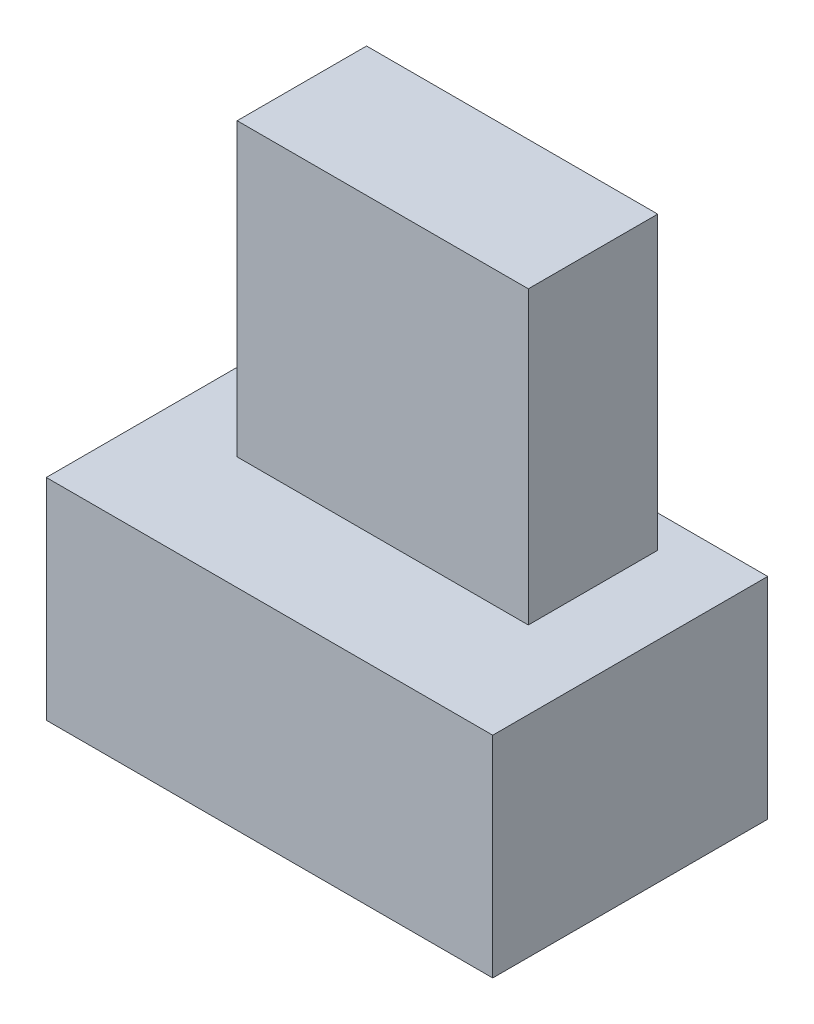
ISO-10303-21;
HEADER;
FILE_DESCRIPTION(('STEP AP214'),'2;1');
FILE_NAME('part.step','',(''),(''),'','','');
FILE_SCHEMA(('AUTOMOTIVE_DESIGN { 1 0 10303 214 1 1 1 1 }'));
ENDSEC;
DATA;
#1=APPLICATION_CONTEXT('core data for automotive mechanical design processes');
#2=APPLICATION_PROTOCOL_DEFINITION('international standard','automotive_design',2000,#1);
#3=PRODUCT_CONTEXT('',#1,'mechanical');
#4=PRODUCT('Part','Part','',(#3));
#5=PRODUCT_RELATED_PRODUCT_CATEGORY('part','',(#4));
#6=PRODUCT_DEFINITION_FORMATION('','',#4);
#7=PRODUCT_DEFINITION_CONTEXT('part definition',#1,'design');
#8=PRODUCT_DEFINITION('design','',#6,#7);
#9=PRODUCT_DEFINITION_SHAPE('','',#8);
#10=(LENGTH_UNIT() NAMED_UNIT(*) SI_UNIT(.MILLI.,.METRE.));
#11=(NAMED_UNIT(*) PLANE_ANGLE_UNIT() SI_UNIT($,.RADIAN.));
#12=(NAMED_UNIT(*) SI_UNIT($,.STERADIAN.) SOLID_ANGLE_UNIT());
#13=UNCERTAINTY_MEASURE_WITH_UNIT(LENGTH_MEASURE(1.E-05),#10,'distance_accuracy_value','');
#14=(GEOMETRIC_REPRESENTATION_CONTEXT(3) GLOBAL_UNCERTAINTY_ASSIGNED_CONTEXT((#13)) GLOBAL_UNIT_ASSIGNED_CONTEXT((#10,
#11,#12)) REPRESENTATION_CONTEXT('',''));
#15=CARTESIAN_POINT('',(0.,0.,0.));
#16=DIRECTION('',(0.,0.,1.));
#17=DIRECTION('',(1.,0.,0.));
#18=AXIS2_PLACEMENT_3D('',#15,#16,#17);
#19=CARTESIAN_POINT('',(0.,6.5,-8.5));
#20=DIRECTION('',(0.,-1.,0.));
#21=DIRECTION('',(0.,0.,-1.));
#22=AXIS2_PLACEMENT_3D('',#19,#20,#21);
#23=PLANE('',#22);
#24=DIRECTION('',(0.,0.,1.));
#25=VECTOR('',#24,1.);
#26=CARTESIAN_POINT('',(0.,6.5,0.));
#27=LINE('',#26,#25);
#28=CARTESIAN_POINT('',(0.,6.5,-8.5));
#29=VERTEX_POINT('',#28);
#30=CARTESIAN_POINT('',(0.,6.5,0.));
#31=VERTEX_POINT('',#30);
#32=EDGE_CURVE('E126',#29,#31,#27,.T.);
#33=ORIENTED_EDGE('',*,*,#32,.T.);
#34=DIRECTION('',(1.,0.,0.));
#35=VECTOR('',#34,1.);
#36=CARTESIAN_POINT('',(0.,6.5,0.));
#37=LINE('',#36,#35);
#38=CARTESIAN_POINT('',(13.8,6.5,0.));
#39=VERTEX_POINT('',#38);
#40=EDGE_CURVE('E129',#31,#39,#37,.T.);
#41=ORIENTED_EDGE('',*,*,#40,.T.);
#42=DIRECTION('',(0.,0.,-1.));
#43=VECTOR('',#42,1.);
#44=CARTESIAN_POINT('',(13.8,6.5,0.));
#45=LINE('',#44,#43);
#46=CARTESIAN_POINT('',(13.8,6.5,-8.5));
#47=VERTEX_POINT('',#46);
#48=EDGE_CURVE('E132',#39,#47,#45,.T.);
#49=ORIENTED_EDGE('',*,*,#48,.T.);
#50=DIRECTION('',(-1.,0.,0.));
#51=VECTOR('',#50,1.);
#52=CARTESIAN_POINT('',(0.,6.5,-8.5));
#53=LINE('',#52,#51);
#54=EDGE_CURVE('E134',#47,#29,#53,.T.);
#55=ORIENTED_EDGE('',*,*,#54,.T.);
#56=EDGE_LOOP('',(#33,#41,#49,#55));
#57=FACE_BOUND('',#56,.T.);
#58=DIRECTION('',(0.,0.,1.));
#59=VECTOR('',#58,1.);
#60=CARTESIAN_POINT('',(2.4,6.5,-3.5));
#61=LINE('',#60,#59);
#62=CARTESIAN_POINT('',(2.4,6.5,-7.5));
#63=VERTEX_POINT('',#62);
#64=CARTESIAN_POINT('',(2.4,6.5,-3.5));
#65=VERTEX_POINT('',#64);
#66=EDGE_CURVE('E116',#63,#65,#61,.T.);
#67=ORIENTED_EDGE('',*,*,#66,.F.);
#68=DIRECTION('',(-1.,0.,0.));
#69=VECTOR('',#68,1.);
#70=CARTESIAN_POINT('',(2.4,6.5,-7.5));
#71=LINE('',#70,#69);
#72=CARTESIAN_POINT('',(11.4,6.5,-7.5));
#73=VERTEX_POINT('',#72);
#74=EDGE_CURVE('E113',#73,#63,#71,.T.);
#75=ORIENTED_EDGE('',*,*,#74,.F.);
#76=DIRECTION('',(0.,0.,-1.));
#77=VECTOR('',#76,1.);
#78=CARTESIAN_POINT('',(11.4,6.5,-3.5));
#79=LINE('',#78,#77);
#80=CARTESIAN_POINT('',(11.4,6.5,-3.5));
#81=VERTEX_POINT('',#80);
#82=EDGE_CURVE('E51',#81,#73,#79,.T.);
#83=ORIENTED_EDGE('',*,*,#82,.F.);
#84=DIRECTION('',(1.,0.,0.));
#85=VECTOR('',#84,1.);
#86=CARTESIAN_POINT('',(2.4,6.5,-3.5));
#87=LINE('',#86,#85);
#88=EDGE_CURVE('E46',#65,#81,#87,.T.);
#89=ORIENTED_EDGE('',*,*,#88,.F.);
#90=EDGE_LOOP('',(#67,#75,#83,#89));
#91=FACE_BOUND('',#90,.T.);
#92=ADVANCED_FACE('F31',(#57,#91),#23,.F.);
#93=CARTESIAN_POINT('',(0.,6.5,0.));
#94=DIRECTION('',(1.,0.,0.));
#95=DIRECTION('',(0.,0.,-1.));
#96=AXIS2_PLACEMENT_3D('',#93,#94,#95);
#97=PLANE('',#96);
#98=DIRECTION('',(0.,0.,1.));
#99=VECTOR('',#98,1.);
#100=CARTESIAN_POINT('',(0.,0.,0.));
#101=LINE('',#100,#99);
#102=CARTESIAN_POINT('',(0.,0.,-8.5));
#103=VERTEX_POINT('',#102);
#104=CARTESIAN_POINT('',(0.,0.,0.));
#105=VERTEX_POINT('',#104);
#106=EDGE_CURVE('E117',#103,#105,#101,.T.);
#107=ORIENTED_EDGE('',*,*,#106,.T.);
#108=DIRECTION('',(0.,-1.,0.));
#109=VECTOR('',#108,1.);
#110=CARTESIAN_POINT('',(0.,6.5,0.));
#111=LINE('',#110,#109);
#112=EDGE_CURVE('E11',#31,#105,#111,.T.);
#113=ORIENTED_EDGE('',*,*,#112,.F.);
#114=ORIENTED_EDGE('',*,*,#32,.F.);
#115=DIRECTION('',(0.,-1.,0.));
#116=VECTOR('',#115,1.);
#117=CARTESIAN_POINT('',(0.,6.5,-8.5));
#118=LINE('',#117,#116);
#119=EDGE_CURVE('E135',#29,#103,#118,.T.);
#120=ORIENTED_EDGE('',*,*,#119,.T.);
#121=EDGE_LOOP('',(#107,#113,#114,#120));
#122=FACE_BOUND('',#121,.T.);
#123=ADVANCED_FACE('F33',(#122),#97,.F.);
#124=CARTESIAN_POINT('',(0.,6.5,0.));
#125=DIRECTION('',(0.,0.,-1.));
#126=DIRECTION('',(-1.,0.,0.));
#127=AXIS2_PLACEMENT_3D('',#124,#125,#126);
#128=PLANE('',#127);
#129=DIRECTION('',(1.,0.,0.));
#130=VECTOR('',#129,1.);
#131=CARTESIAN_POINT('',(0.,0.,0.));
#132=LINE('',#131,#130);
#133=CARTESIAN_POINT('',(13.8,0.,0.));
#134=VERTEX_POINT('',#133);
#135=EDGE_CURVE('E120',#105,#134,#132,.T.);
#136=ORIENTED_EDGE('',*,*,#135,.T.);
#137=DIRECTION('',(0.,-1.,0.));
#138=VECTOR('',#137,1.);
#139=CARTESIAN_POINT('',(13.8,6.5,0.));
#140=LINE('',#139,#138);
#141=EDGE_CURVE('E39',#39,#134,#140,.T.);
#142=ORIENTED_EDGE('',*,*,#141,.F.);
#143=ORIENTED_EDGE('',*,*,#40,.F.);
#144=ORIENTED_EDGE('',*,*,#112,.T.);
#145=EDGE_LOOP('',(#136,#142,#143,#144));
#146=FACE_BOUND('',#145,.T.);
#147=ADVANCED_FACE('F165',(#146),#128,.F.);
#148=CARTESIAN_POINT('',(13.8,6.5,0.));
#149=DIRECTION('',(-1.,0.,0.));
#150=DIRECTION('',(0.,0.,1.));
#151=AXIS2_PLACEMENT_3D('',#148,#149,#150);
#152=PLANE('',#151);
#153=DIRECTION('',(0.,0.,-1.));
#154=VECTOR('',#153,1.);
#155=CARTESIAN_POINT('',(13.8,0.,0.));
#156=LINE('',#155,#154);
#157=CARTESIAN_POINT('',(13.8,0.,-8.5));
#158=VERTEX_POINT('',#157);
#159=EDGE_CURVE('E138',#134,#158,#156,.T.);
#160=ORIENTED_EDGE('',*,*,#159,.T.);
#161=DIRECTION('',(0.,-1.,0.));
#162=VECTOR('',#161,1.);
#163=CARTESIAN_POINT('',(13.8,6.5,-8.5));
#164=LINE('',#163,#162);
#165=EDGE_CURVE('E143',#47,#158,#164,.T.);
#166=ORIENTED_EDGE('',*,*,#165,.F.);
#167=ORIENTED_EDGE('',*,*,#48,.F.);
#168=ORIENTED_EDGE('',*,*,#141,.T.);
#169=EDGE_LOOP('',(#160,#166,#167,#168));
#170=FACE_BOUND('',#169,.T.);
#171=ADVANCED_FACE('F150',(#170),#152,.F.);
#172=CARTESIAN_POINT('',(0.,6.5,-8.5));
#173=DIRECTION('',(0.,0.,1.));
#174=DIRECTION('',(1.,0.,0.));
#175=AXIS2_PLACEMENT_3D('',#172,#173,#174);
#176=PLANE('',#175);
#177=DIRECTION('',(-1.,0.,0.));
#178=VECTOR('',#177,1.);
#179=CARTESIAN_POINT('',(0.,0.,-8.5));
#180=LINE('',#179,#178);
#181=EDGE_CURVE('E130',#158,#103,#180,.T.);
#182=ORIENTED_EDGE('',*,*,#181,.T.);
#183=ORIENTED_EDGE('',*,*,#119,.F.);
#184=ORIENTED_EDGE('',*,*,#54,.F.);
#185=ORIENTED_EDGE('',*,*,#165,.T.);
#186=EDGE_LOOP('',(#182,#183,#184,#185));
#187=FACE_BOUND('',#186,.T.);
#188=ADVANCED_FACE('F159',(#187),#176,.F.);
#189=CARTESIAN_POINT('',(0.,0.,-8.5));
#190=DIRECTION('',(0.,-1.,0.));
#191=DIRECTION('',(0.,0.,-1.));
#192=AXIS2_PLACEMENT_3D('',#189,#190,#191);
#193=PLANE('',#192);
#194=ORIENTED_EDGE('',*,*,#106,.F.);
#195=ORIENTED_EDGE('',*,*,#181,.F.);
#196=ORIENTED_EDGE('',*,*,#159,.F.);
#197=ORIENTED_EDGE('',*,*,#135,.F.);
#198=EDGE_LOOP('',(#194,#195,#196,#197));
#199=FACE_BOUND('',#198,.T.);
#200=ADVANCED_FACE('F156',(#199),#193,.T.);
#201=CARTESIAN_POINT('',(2.4,15.5,-3.5));
#202=DIRECTION('',(1.,0.,0.));
#203=DIRECTION('',(0.,0.,-1.));
#204=AXIS2_PLACEMENT_3D('',#201,#202,#203);
#205=PLANE('',#204);
#206=ORIENTED_EDGE('',*,*,#66,.T.);
#207=DIRECTION('',(0.,-1.,0.));
#208=VECTOR('',#207,1.);
#209=CARTESIAN_POINT('',(2.4,15.5,-3.5));
#210=LINE('',#209,#208);
#211=CARTESIAN_POINT('',(2.4,15.5,-3.5));
#212=VERTEX_POINT('',#211);
#213=EDGE_CURVE('E97',#212,#65,#210,.T.);
#214=ORIENTED_EDGE('',*,*,#213,.F.);
#215=DIRECTION('',(0.,0.,1.));
#216=VECTOR('',#215,1.);
#217=CARTESIAN_POINT('',(2.4,15.5,-3.5));
#218=LINE('',#217,#216);
#219=CARTESIAN_POINT('',(2.4,15.5,-7.5));
#220=VERTEX_POINT('',#219);
#221=EDGE_CURVE('E104',#220,#212,#218,.T.);
#222=ORIENTED_EDGE('',*,*,#221,.F.);
#223=DIRECTION('',(0.,-1.,0.));
#224=VECTOR('',#223,1.);
#225=CARTESIAN_POINT('',(2.4,15.5,-7.5));
#226=LINE('',#225,#224);
#227=EDGE_CURVE('E258',#220,#63,#226,.T.);
#228=ORIENTED_EDGE('',*,*,#227,.T.);
#229=EDGE_LOOP('',(#206,#214,#222,#228));
#230=FACE_BOUND('',#229,.T.);
#231=ADVANCED_FACE('F115',(#230),#205,.F.);
#232=CARTESIAN_POINT('',(2.4,15.5,-3.5));
#233=DIRECTION('',(0.,0.,-1.));
#234=DIRECTION('',(-1.,0.,0.));
#235=AXIS2_PLACEMENT_3D('',#232,#233,#234);
#236=PLANE('',#235);
#237=ORIENTED_EDGE('',*,*,#88,.T.);
#238=DIRECTION('',(0.,-1.,0.));
#239=VECTOR('',#238,1.);
#240=CARTESIAN_POINT('',(11.4,15.5,-3.5));
#241=LINE('',#240,#239);
#242=CARTESIAN_POINT('',(11.4,15.5,-3.5));
#243=VERTEX_POINT('',#242);
#244=EDGE_CURVE('E100',#243,#81,#241,.T.);
#245=ORIENTED_EDGE('',*,*,#244,.F.);
#246=DIRECTION('',(1.,0.,0.));
#247=VECTOR('',#246,1.);
#248=CARTESIAN_POINT('',(2.4,15.5,-3.5));
#249=LINE('',#248,#247);
#250=EDGE_CURVE('E93',#212,#243,#249,.T.);
#251=ORIENTED_EDGE('',*,*,#250,.F.);
#252=ORIENTED_EDGE('',*,*,#213,.T.);
#253=EDGE_LOOP('',(#237,#245,#251,#252));
#254=FACE_BOUND('',#253,.T.);
#255=ADVANCED_FACE('F95',(#254),#236,.F.);
#256=CARTESIAN_POINT('',(11.4,15.5,-3.5));
#257=DIRECTION('',(-1.,0.,0.));
#258=DIRECTION('',(0.,0.,1.));
#259=AXIS2_PLACEMENT_3D('',#256,#257,#258);
#260=PLANE('',#259);
#261=ORIENTED_EDGE('',*,*,#82,.T.);
#262=DIRECTION('',(0.,-1.,0.));
#263=VECTOR('',#262,1.);
#264=CARTESIAN_POINT('',(11.4,15.5,-7.5));
#265=LINE('',#264,#263);
#266=CARTESIAN_POINT('',(11.4,15.5,-7.5));
#267=VERTEX_POINT('',#266);
#268=EDGE_CURVE('E122',#267,#73,#265,.T.);
#269=ORIENTED_EDGE('',*,*,#268,.F.);
#270=DIRECTION('',(0.,0.,-1.));
#271=VECTOR('',#270,1.);
#272=CARTESIAN_POINT('',(11.4,15.5,-3.5));
#273=LINE('',#272,#271);
#274=EDGE_CURVE('E103',#243,#267,#273,.T.);
#275=ORIENTED_EDGE('',*,*,#274,.F.);
#276=ORIENTED_EDGE('',*,*,#244,.T.);
#277=EDGE_LOOP('',(#261,#269,#275,#276));
#278=FACE_BOUND('',#277,.T.);
#279=ADVANCED_FACE('F201',(#278),#260,.F.);
#280=CARTESIAN_POINT('',(2.4,15.5,-7.5));
#281=DIRECTION('',(0.,0.,1.));
#282=DIRECTION('',(1.,0.,0.));
#283=AXIS2_PLACEMENT_3D('',#280,#281,#282);
#284=PLANE('',#283);
#285=ORIENTED_EDGE('',*,*,#74,.T.);
#286=ORIENTED_EDGE('',*,*,#227,.F.);
#287=DIRECTION('',(-1.,0.,0.));
#288=VECTOR('',#287,1.);
#289=CARTESIAN_POINT('',(2.4,15.5,-7.5));
#290=LINE('',#289,#288);
#291=EDGE_CURVE('E109',#267,#220,#290,.T.);
#292=ORIENTED_EDGE('',*,*,#291,.F.);
#293=ORIENTED_EDGE('',*,*,#268,.T.);
#294=EDGE_LOOP('',(#285,#286,#292,#293));
#295=FACE_BOUND('',#294,.T.);
#296=ADVANCED_FACE('F207',(#295),#284,.F.);
#297=CARTESIAN_POINT('',(2.4,15.5,-7.5));
#298=DIRECTION('',(0.,-1.,0.));
#299=DIRECTION('',(0.,0.,-1.));
#300=AXIS2_PLACEMENT_3D('',#297,#298,#299);
#301=PLANE('',#300);
#302=ORIENTED_EDGE('',*,*,#221,.T.);
#303=ORIENTED_EDGE('',*,*,#250,.T.);
#304=ORIENTED_EDGE('',*,*,#274,.T.);
#305=ORIENTED_EDGE('',*,*,#291,.T.);
#306=EDGE_LOOP('',(#302,#303,#304,#305));
#307=FACE_BOUND('',#306,.T.);
#308=ADVANCED_FACE('F107',(#307),#301,.F.);
#309=CLOSED_SHELL('',(#92,#123,#147,#171,#188,#200,#231,#255,#279,#296,#308));
#310=MANIFOLD_SOLID_BREP('B2',#309);
#311=ADVANCED_BREP_SHAPE_REPRESENTATION('',(#18,#310),#14);
#312=SHAPE_DEFINITION_REPRESENTATION(#9,#311);
ENDSEC;
END-ISO-10303-21;
